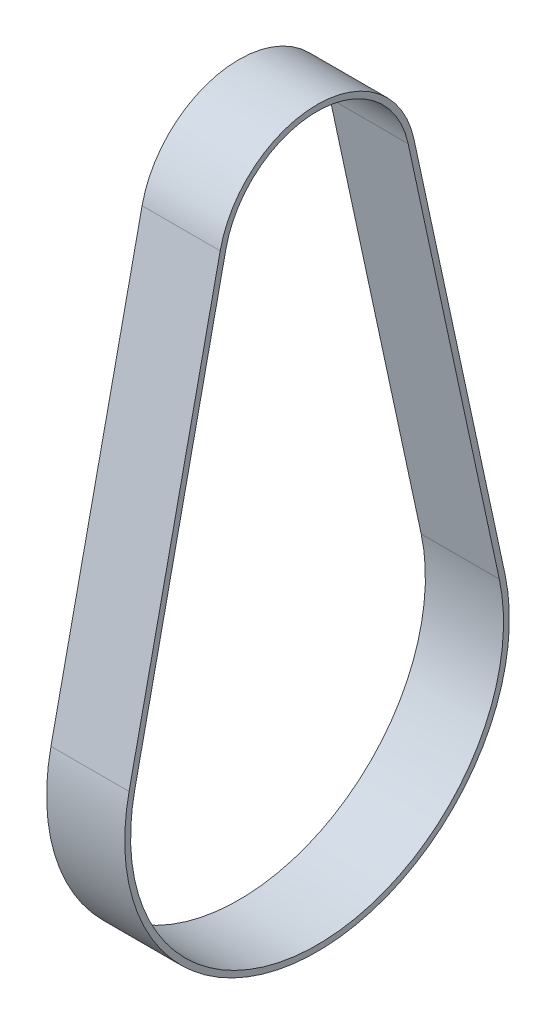
ISO-10303-21;
HEADER;
FILE_DESCRIPTION(('STEP AP214'),'2;1');
FILE_NAME('part.step','',(''),(''),'','','');
FILE_SCHEMA(('AUTOMOTIVE_DESIGN { 1 0 10303 214 1 1 1 1 }'));
ENDSEC;
DATA;
#1=APPLICATION_CONTEXT('core data for automotive mechanical design processes');
#2=APPLICATION_PROTOCOL_DEFINITION('international standard','automotive_design',2000,#1);
#3=PRODUCT_CONTEXT('',#1,'mechanical');
#4=PRODUCT('Part','Part','',(#3));
#5=PRODUCT_RELATED_PRODUCT_CATEGORY('part','',(#4));
#6=PRODUCT_DEFINITION_FORMATION('','',#4);
#7=PRODUCT_DEFINITION_CONTEXT('part definition',#1,'design');
#8=PRODUCT_DEFINITION('design','',#6,#7);
#9=PRODUCT_DEFINITION_SHAPE('','',#8);
#10=(LENGTH_UNIT() NAMED_UNIT(*) SI_UNIT(.MILLI.,.METRE.));
#11=(NAMED_UNIT(*) PLANE_ANGLE_UNIT() SI_UNIT($,.RADIAN.));
#12=(NAMED_UNIT(*) SI_UNIT($,.STERADIAN.) SOLID_ANGLE_UNIT());
#13=UNCERTAINTY_MEASURE_WITH_UNIT(LENGTH_MEASURE(1.E-05),#10,'distance_accuracy_value','');
#14=(GEOMETRIC_REPRESENTATION_CONTEXT(3) GLOBAL_UNCERTAINTY_ASSIGNED_CONTEXT((#13)) GLOBAL_UNIT_ASSIGNED_CONTEXT((#10,
#11,#12)) REPRESENTATION_CONTEXT('',''));
#15=CARTESIAN_POINT('',(0.,0.,0.));
#16=DIRECTION('',(0.,0.,1.));
#17=DIRECTION('',(1.,0.,0.));
#18=AXIS2_PLACEMENT_3D('',#15,#16,#17);
#19=CARTESIAN_POINT('',(16.,90.6,0.));
#20=DIRECTION('',(1.,0.,0.));
#21=DIRECTION('',(0.,0.,-1.));
#22=AXIS2_PLACEMENT_3D('',#19,#20,#21);
#23=PLANE('',#22);
#24=CARTESIAN_POINT('',(16.,90.6,0.));
#25=DIRECTION('',(1.,0.,0.));
#26=DIRECTION('',(0.,0.,-1.));
#27=AXIS2_PLACEMENT_3D('',#24,#25,#26);
#28=CIRCLE('',#27,20.2985);
#29=CARTESIAN_POINT('',(16.,94.8784801903974,-19.8424723638557));
#30=VERTEX_POINT('',#29);
#31=CARTESIAN_POINT('',(16.,94.8784801903974,19.8424723638557));
#32=VERTEX_POINT('',#31);
#33=EDGE_CURVE('E135',#30,#32,#28,.T.);
#34=ORIENTED_EDGE('',*,*,#33,.T.);
#35=DIRECTION('',(0.,-0.97753392437154,0.210778145695364));
#36=VECTOR('',#35,1.);
#37=CARTESIAN_POINT('',(16.,94.8784801903974,19.8424723638557));
#38=LINE('',#37,#36);
#39=CARTESIAN_POINT('',(16.,8.30360504966887,38.5099489506168));
#40=VERTEX_POINT('',#39);
#41=EDGE_CURVE('E138',#32,#40,#38,.T.);
#42=ORIENTED_EDGE('',*,*,#41,.T.);
#43=CARTESIAN_POINT('',(16.,0.,0.));
#44=DIRECTION('',(1.,0.,0.));
#45=DIRECTION('',(0.,0.,-1.));
#46=AXIS2_PLACEMENT_3D('',#43,#44,#45);
#47=CIRCLE('',#46,39.395);
#48=CARTESIAN_POINT('',(16.,8.30360504966887,-38.5099489506168));
#49=VERTEX_POINT('',#48);
#50=EDGE_CURVE('E141',#40,#49,#47,.T.);
#51=ORIENTED_EDGE('',*,*,#50,.T.);
#52=DIRECTION('',(0.,0.97753392437154,0.210778145695364));
#53=VECTOR('',#52,1.);
#54=CARTESIAN_POINT('',(16.,94.8784801903974,-19.8424723638557));
#55=LINE('',#54,#53);
#56=EDGE_CURVE('E143',#49,#30,#55,.T.);
#57=ORIENTED_EDGE('',*,*,#56,.T.);
#58=EDGE_LOOP('',(#34,#42,#51,#57));
#59=FACE_BOUND('',#58,.T.);
#60=DIRECTION('',(0.,0.97753392437154,0.210778145695364));
#61=VECTOR('',#60,1.);
#62=CARTESIAN_POINT('',(16.,8.05067127483444,-37.336908241371));
#63=LINE('',#62,#61);
#64=CARTESIAN_POINT('',(16.,8.05067127483444,-37.336908241371));
#65=VERTEX_POINT('',#64);
#66=CARTESIAN_POINT('',(16.,94.6255464155629,-18.6694316546099));
#67=VERTEX_POINT('',#66);
#68=EDGE_CURVE('E107',#65,#67,#63,.T.);
#69=ORIENTED_EDGE('',*,*,#68,.F.);
#70=CARTESIAN_POINT('',(16.,0.,0.));
#71=DIRECTION('',(1.,0.,0.));
#72=DIRECTION('',(0.,0.,-1.));
#73=AXIS2_PLACEMENT_3D('',#70,#71,#72);
#74=CIRCLE('',#73,38.195);
#75=CARTESIAN_POINT('',(16.,8.05067127483444,37.336908241371));
#76=VERTEX_POINT('',#75);
#77=EDGE_CURVE('E99',#76,#65,#74,.T.);
#78=ORIENTED_EDGE('',*,*,#77,.F.);
#79=DIRECTION('',(0.,-0.97753392437154,0.210778145695364));
#80=VECTOR('',#79,1.);
#81=CARTESIAN_POINT('',(16.,8.05067127483444,37.336908241371));
#82=LINE('',#81,#80);
#83=CARTESIAN_POINT('',(16.,94.6255464155629,18.6694316546099));
#84=VERTEX_POINT('',#83);
#85=EDGE_CURVE('E121',#84,#76,#82,.T.);
#86=ORIENTED_EDGE('',*,*,#85,.F.);
#87=CARTESIAN_POINT('',(16.,90.6,0.));
#88=DIRECTION('',(1.,0.,0.));
#89=DIRECTION('',(0.,0.,-1.));
#90=AXIS2_PLACEMENT_3D('',#87,#88,#89);
#91=CIRCLE('',#90,19.0985);
#92=EDGE_CURVE('E119',#67,#84,#91,.T.);
#93=ORIENTED_EDGE('',*,*,#92,.F.);
#94=EDGE_LOOP('',(#69,#78,#86,#93));
#95=FACE_BOUND('',#94,.T.);
#96=ADVANCED_FACE('F34',(#59,#95),#23,.T.);
#97=CARTESIAN_POINT('',(0.,90.6,0.));
#98=DIRECTION('',(1.,0.,0.));
#99=DIRECTION('',(0.,0.,-1.));
#100=AXIS2_PLACEMENT_3D('',#97,#98,#99);
#101=PLANE('',#100);
#102=CARTESIAN_POINT('',(0.,90.6,0.));
#103=DIRECTION('',(1.,0.,0.));
#104=DIRECTION('',(0.,0.,-1.));
#105=AXIS2_PLACEMENT_3D('',#102,#103,#104);
#106=CIRCLE('',#105,20.2985);
#107=CARTESIAN_POINT('',(0.,94.8784801903974,-19.8424723638557));
#108=VERTEX_POINT('',#107);
#109=CARTESIAN_POINT('',(0.,94.8784801903974,19.8424723638557));
#110=VERTEX_POINT('',#109);
#111=EDGE_CURVE('E115',#108,#110,#106,.T.);
#112=ORIENTED_EDGE('',*,*,#111,.F.);
#113=DIRECTION('',(0.,0.97753392437154,0.210778145695364));
#114=VECTOR('',#113,1.);
#115=CARTESIAN_POINT('',(0.,94.8784801903974,-19.8424723638557));
#116=LINE('',#115,#114);
#117=CARTESIAN_POINT('',(0.,8.30360504966887,-38.5099489506168));
#118=VERTEX_POINT('',#117);
#119=EDGE_CURVE('E139',#118,#108,#116,.T.);
#120=ORIENTED_EDGE('',*,*,#119,.F.);
#121=CARTESIAN_POINT('',(0.,0.,0.));
#122=DIRECTION('',(1.,0.,0.));
#123=DIRECTION('',(0.,0.,-1.));
#124=AXIS2_PLACEMENT_3D('',#121,#122,#123);
#125=CIRCLE('',#124,39.395);
#126=CARTESIAN_POINT('',(0.,8.30360504966887,38.5099489506168));
#127=VERTEX_POINT('',#126);
#128=EDGE_CURVE('E150',#127,#118,#125,.T.);
#129=ORIENTED_EDGE('',*,*,#128,.F.);
#130=DIRECTION('',(0.,-0.97753392437154,0.210778145695364));
#131=VECTOR('',#130,1.);
#132=CARTESIAN_POINT('',(0.,94.8784801903974,19.8424723638557));
#133=LINE('',#132,#131);
#134=EDGE_CURVE('E148',#110,#127,#133,.T.);
#135=ORIENTED_EDGE('',*,*,#134,.F.);
#136=EDGE_LOOP('',(#112,#120,#129,#135));
#137=FACE_BOUND('',#136,.T.);
#138=CARTESIAN_POINT('',(0.,0.,0.));
#139=DIRECTION('',(1.,0.,0.));
#140=DIRECTION('',(0.,0.,-1.));
#141=AXIS2_PLACEMENT_3D('',#138,#139,#140);
#142=CIRCLE('',#141,38.195);
#143=CARTESIAN_POINT('',(0.,8.05067127483444,37.336908241371));
#144=VERTEX_POINT('',#143);
#145=CARTESIAN_POINT('',(0.,8.05067127483444,-37.336908241371));
#146=VERTEX_POINT('',#145);
#147=EDGE_CURVE('E57',#144,#146,#142,.T.);
#148=ORIENTED_EDGE('',*,*,#147,.T.);
#149=DIRECTION('',(0.,0.97753392437154,0.210778145695364));
#150=VECTOR('',#149,1.);
#151=CARTESIAN_POINT('',(0.,8.05067127483444,-37.336908241371));
#152=LINE('',#151,#150);
#153=CARTESIAN_POINT('',(0.,94.6255464155629,-18.6694316546099));
#154=VERTEX_POINT('',#153);
#155=EDGE_CURVE('E114',#146,#154,#152,.T.);
#156=ORIENTED_EDGE('',*,*,#155,.T.);
#157=CARTESIAN_POINT('',(0.,90.6,0.));
#158=DIRECTION('',(1.,0.,0.));
#159=DIRECTION('',(0.,0.,-1.));
#160=AXIS2_PLACEMENT_3D('',#157,#158,#159);
#161=CIRCLE('',#160,19.0985);
#162=CARTESIAN_POINT('',(0.,94.6255464155629,18.6694316546099));
#163=VERTEX_POINT('',#162);
#164=EDGE_CURVE('E127',#154,#163,#161,.T.);
#165=ORIENTED_EDGE('',*,*,#164,.T.);
#166=DIRECTION('',(0.,-0.97753392437154,0.210778145695364));
#167=VECTOR('',#166,1.);
#168=CARTESIAN_POINT('',(0.,8.05067127483444,37.336908241371));
#169=LINE('',#168,#167);
#170=EDGE_CURVE('E108',#163,#144,#169,.T.);
#171=ORIENTED_EDGE('',*,*,#170,.T.);
#172=EDGE_LOOP('',(#148,#156,#165,#171));
#173=FACE_BOUND('',#172,.T.);
#174=ADVANCED_FACE('F168',(#137,#173),#101,.F.);
#175=CARTESIAN_POINT('',(16.,90.6,0.));
#176=DIRECTION('',(-1.,0.,0.));
#177=DIRECTION('',(0.,0.,1.));
#178=AXIS2_PLACEMENT_3D('',#175,#176,#177);
#179=CYLINDRICAL_SURFACE('',#178,20.2985);
#180=ORIENTED_EDGE('',*,*,#111,.T.);
#181=DIRECTION('',(-1.,0.,0.));
#182=VECTOR('',#181,1.);
#183=CARTESIAN_POINT('',(16.,94.8784801903974,19.8424723638557));
#184=LINE('',#183,#182);
#185=EDGE_CURVE('E11',#32,#110,#184,.T.);
#186=ORIENTED_EDGE('',*,*,#185,.F.);
#187=ORIENTED_EDGE('',*,*,#33,.F.);
#188=DIRECTION('',(-1.,0.,0.));
#189=VECTOR('',#188,1.);
#190=CARTESIAN_POINT('',(16.,94.8784801903974,-19.8424723638557));
#191=LINE('',#190,#189);
#192=EDGE_CURVE('E145',#30,#108,#191,.T.);
#193=ORIENTED_EDGE('',*,*,#192,.T.);
#194=EDGE_LOOP('',(#180,#186,#187,#193));
#195=FACE_BOUND('',#194,.T.);
#196=ADVANCED_FACE('F36',(#195),#179,.T.);
#197=CARTESIAN_POINT('',(16.,94.8784801903974,19.8424723638557));
#198=DIRECTION('',(0.,-0.210778145695364,-0.97753392437154));
#199=DIRECTION('',(0.,0.97753392437154,-0.210778145695364));
#200=AXIS2_PLACEMENT_3D('',#197,#198,#199);
#201=PLANE('',#200);
#202=ORIENTED_EDGE('',*,*,#134,.T.);
#203=DIRECTION('',(-1.,0.,0.));
#204=VECTOR('',#203,1.);
#205=CARTESIAN_POINT('',(16.,8.30360504966887,38.5099489506168));
#206=LINE('',#205,#204);
#207=EDGE_CURVE('E42',#40,#127,#206,.T.);
#208=ORIENTED_EDGE('',*,*,#207,.F.);
#209=ORIENTED_EDGE('',*,*,#41,.F.);
#210=ORIENTED_EDGE('',*,*,#185,.T.);
#211=EDGE_LOOP('',(#202,#208,#209,#210));
#212=FACE_BOUND('',#211,.T.);
#213=ADVANCED_FACE('F178',(#212),#201,.F.);
#214=CARTESIAN_POINT('',(16.,0.,0.));
#215=DIRECTION('',(-1.,0.,0.));
#216=DIRECTION('',(0.,0.,1.));
#217=AXIS2_PLACEMENT_3D('',#214,#215,#216);
#218=CYLINDRICAL_SURFACE('',#217,39.395);
#219=ORIENTED_EDGE('',*,*,#128,.T.);
#220=DIRECTION('',(-1.,0.,0.));
#221=VECTOR('',#220,1.);
#222=CARTESIAN_POINT('',(16.,8.30360504966887,-38.5099489506168));
#223=LINE('',#222,#221);
#224=EDGE_CURVE('E155',#49,#118,#223,.T.);
#225=ORIENTED_EDGE('',*,*,#224,.F.);
#226=ORIENTED_EDGE('',*,*,#50,.F.);
#227=ORIENTED_EDGE('',*,*,#207,.T.);
#228=EDGE_LOOP('',(#219,#225,#226,#227));
#229=FACE_BOUND('',#228,.T.);
#230=ADVANCED_FACE('F162',(#229),#218,.T.);
#231=CARTESIAN_POINT('',(16.,94.8784801903974,-19.8424723638557));
#232=DIRECTION('',(0.,-0.210778145695364,0.97753392437154));
#233=DIRECTION('',(0.,-0.97753392437154,-0.210778145695364));
#234=AXIS2_PLACEMENT_3D('',#231,#232,#233);
#235=PLANE('',#234);
#236=ORIENTED_EDGE('',*,*,#119,.T.);
#237=ORIENTED_EDGE('',*,*,#192,.F.);
#238=ORIENTED_EDGE('',*,*,#56,.F.);
#239=ORIENTED_EDGE('',*,*,#224,.T.);
#240=EDGE_LOOP('',(#236,#237,#238,#239));
#241=FACE_BOUND('',#240,.T.);
#242=ADVANCED_FACE('F172',(#241),#235,.F.);
#243=CARTESIAN_POINT('',(16.,0.,0.));
#244=DIRECTION('',(-1.,0.,0.));
#245=DIRECTION('',(0.,0.,1.));
#246=AXIS2_PLACEMENT_3D('',#243,#244,#245);
#247=CYLINDRICAL_SURFACE('',#246,38.195);
#248=ORIENTED_EDGE('',*,*,#147,.F.);
#249=DIRECTION('',(-1.,0.,0.));
#250=VECTOR('',#249,1.);
#251=CARTESIAN_POINT('',(16.,8.05067127483444,37.336908241371));
#252=LINE('',#251,#250);
#253=EDGE_CURVE('E103',#76,#144,#252,.T.);
#254=ORIENTED_EDGE('',*,*,#253,.F.);
#255=ORIENTED_EDGE('',*,*,#77,.T.);
#256=DIRECTION('',(-1.,0.,0.));
#257=VECTOR('',#256,1.);
#258=CARTESIAN_POINT('',(16.,8.05067127483444,-37.336908241371));
#259=LINE('',#258,#257);
#260=EDGE_CURVE('E102',#65,#146,#259,.T.);
#261=ORIENTED_EDGE('',*,*,#260,.T.);
#262=EDGE_LOOP('',(#248,#254,#255,#261));
#263=FACE_BOUND('',#262,.T.);
#264=ADVANCED_FACE('F101',(#263),#247,.F.);
#265=CARTESIAN_POINT('',(16.,8.05067127483444,-37.336908241371));
#266=DIRECTION('',(0.,-0.210778145695364,0.97753392437154));
#267=DIRECTION('',(0.,-0.97753392437154,-0.210778145695364));
#268=AXIS2_PLACEMENT_3D('',#265,#266,#267);
#269=PLANE('',#268);
#270=ORIENTED_EDGE('',*,*,#155,.F.);
#271=ORIENTED_EDGE('',*,*,#260,.F.);
#272=ORIENTED_EDGE('',*,*,#68,.T.);
#273=DIRECTION('',(-1.,0.,0.));
#274=VECTOR('',#273,1.);
#275=CARTESIAN_POINT('',(16.,94.6255464155629,-18.6694316546099));
#276=LINE('',#275,#274);
#277=EDGE_CURVE('E116',#67,#154,#276,.T.);
#278=ORIENTED_EDGE('',*,*,#277,.T.);
#279=EDGE_LOOP('',(#270,#271,#272,#278));
#280=FACE_BOUND('',#279,.T.);
#281=ADVANCED_FACE('F111',(#280),#269,.T.);
#282=CARTESIAN_POINT('',(16.,90.6,0.));
#283=DIRECTION('',(-1.,0.,0.));
#284=DIRECTION('',(0.,0.,1.));
#285=AXIS2_PLACEMENT_3D('',#282,#283,#284);
#286=CYLINDRICAL_SURFACE('',#285,19.0985);
#287=ORIENTED_EDGE('',*,*,#164,.F.);
#288=ORIENTED_EDGE('',*,*,#277,.F.);
#289=ORIENTED_EDGE('',*,*,#92,.T.);
#290=DIRECTION('',(-1.,0.,0.));
#291=VECTOR('',#290,1.);
#292=CARTESIAN_POINT('',(16.,94.6255464155629,18.6694316546099));
#293=LINE('',#292,#291);
#294=EDGE_CURVE('E49',#84,#163,#293,.T.);
#295=ORIENTED_EDGE('',*,*,#294,.T.);
#296=EDGE_LOOP('',(#287,#288,#289,#295));
#297=FACE_BOUND('',#296,.T.);
#298=ADVANCED_FACE('F201',(#297),#286,.F.);
#299=CARTESIAN_POINT('',(16.,8.05067127483444,37.336908241371));
#300=DIRECTION('',(0.,-0.210778145695364,-0.97753392437154));
#301=DIRECTION('',(0.,0.97753392437154,-0.210778145695364));
#302=AXIS2_PLACEMENT_3D('',#299,#300,#301);
#303=PLANE('',#302);
#304=ORIENTED_EDGE('',*,*,#170,.F.);
#305=ORIENTED_EDGE('',*,*,#294,.F.);
#306=ORIENTED_EDGE('',*,*,#85,.T.);
#307=ORIENTED_EDGE('',*,*,#253,.T.);
#308=EDGE_LOOP('',(#304,#305,#306,#307));
#309=FACE_BOUND('',#308,.T.);
#310=ADVANCED_FACE('F205',(#309),#303,.T.);
#311=CLOSED_SHELL('',(#96,#174,#196,#213,#230,#242,#264,#281,#298,#310));
#312=MANIFOLD_SOLID_BREP('B2',#311);
#313=ADVANCED_BREP_SHAPE_REPRESENTATION('',(#18,#312),#14);
#314=SHAPE_DEFINITION_REPRESENTATION(#9,#313);
ENDSEC;
END-ISO-10303-21;
